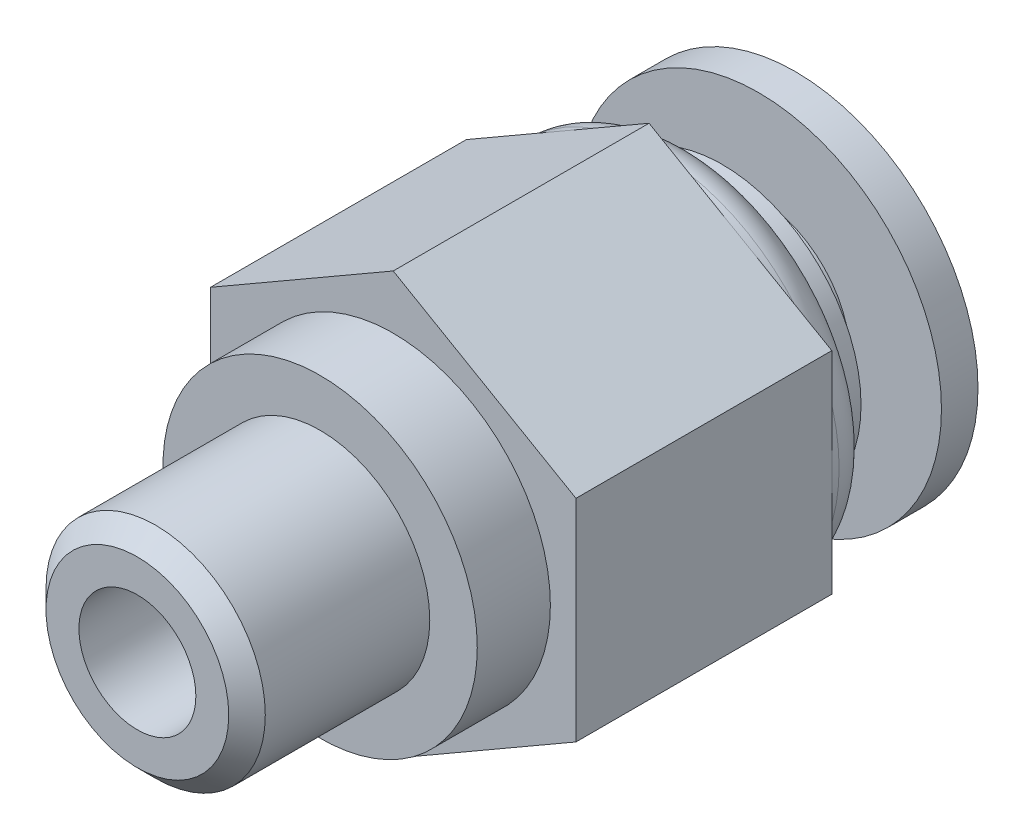
ISO-10303-21;
HEADER;
FILE_DESCRIPTION(('STEP AP214'),'2;1');
FILE_NAME('part.step','',(''),(''),'','','');
FILE_SCHEMA(('AUTOMOTIVE_DESIGN { 1 0 10303 214 1 1 1 1 }'));
ENDSEC;
DATA;
#1=APPLICATION_CONTEXT('core data for automotive mechanical design processes');
#2=APPLICATION_PROTOCOL_DEFINITION('international standard','automotive_design',2000,#1);
#3=PRODUCT_CONTEXT('',#1,'mechanical');
#4=PRODUCT('Part','Part','',(#3));
#5=PRODUCT_RELATED_PRODUCT_CATEGORY('part','',(#4));
#6=PRODUCT_DEFINITION_FORMATION('','',#4);
#7=PRODUCT_DEFINITION_CONTEXT('part definition',#1,'design');
#8=PRODUCT_DEFINITION('design','',#6,#7);
#9=PRODUCT_DEFINITION_SHAPE('','',#8);
#10=(LENGTH_UNIT() NAMED_UNIT(*) SI_UNIT(.MILLI.,.METRE.));
#11=(NAMED_UNIT(*) PLANE_ANGLE_UNIT() SI_UNIT($,.RADIAN.));
#12=(NAMED_UNIT(*) SI_UNIT($,.STERADIAN.) SOLID_ANGLE_UNIT());
#13=UNCERTAINTY_MEASURE_WITH_UNIT(LENGTH_MEASURE(1.E-05),#10,'distance_accuracy_value','');
#14=(GEOMETRIC_REPRESENTATION_CONTEXT(3) GLOBAL_UNCERTAINTY_ASSIGNED_CONTEXT((#13)) GLOBAL_UNIT_ASSIGNED_CONTEXT((#10,
#11,#12)) REPRESENTATION_CONTEXT('',''));
#15=CARTESIAN_POINT('',(0.,0.,0.));
#16=DIRECTION('',(0.,0.,1.));
#17=DIRECTION('',(1.,0.,0.));
#18=AXIS2_PLACEMENT_3D('',#15,#16,#17);
#19=CARTESIAN_POINT('',(0.,2.,-4.));
#20=DIRECTION('',(0.,0.,1.));
#21=DIRECTION('',(0.,-1.,0.));
#22=AXIS2_PLACEMENT_3D('',#19,#20,#21);
#23=PLANE('',#22);
#24=CARTESIAN_POINT('',(0.,0.,-4.));
#25=DIRECTION('',(0.,0.,1.));
#26=DIRECTION('',(0.,-1.,0.));
#27=AXIS2_PLACEMENT_3D('',#24,#25,#26);
#28=CIRCLE('',#27,5.);
#29=CARTESIAN_POINT('',(0.,-5.,-4.));
#30=VERTEX_POINT('',#29);
#31=EDGE_CURVE('E63',#30,#30,#28,.T.);
#32=ORIENTED_EDGE('',*,*,#31,.T.);
#33=EDGE_LOOP('',(#32));
#34=FACE_BOUND('',#33,.T.);
#35=CARTESIAN_POINT('',(0.,0.,-4.));
#36=DIRECTION('',(0.,0.,1.));
#37=DIRECTION('',(0.,-1.,0.));
#38=AXIS2_PLACEMENT_3D('',#35,#36,#37);
#39=CIRCLE('',#38,2.);
#40=CARTESIAN_POINT('',(0.,-2.,-4.));
#41=VERTEX_POINT('',#40);
#42=EDGE_CURVE('E47',#41,#41,#39,.T.);
#43=ORIENTED_EDGE('',*,*,#42,.F.);
#44=EDGE_LOOP('',(#43));
#45=FACE_BOUND('',#44,.T.);
#46=ADVANCED_FACE('F44',(#34,#45),#23,.T.);
#47=CARTESIAN_POINT('',(0.,0.,1.31728685876942));
#48=DIRECTION('',(0.,0.,1.));
#49=DIRECTION('',(0.,-1.,0.));
#50=AXIS2_PLACEMENT_3D('',#47,#48,#49);
#51=CYLINDRICAL_SURFACE('',#50,2.);
#52=ORIENTED_EDGE('',*,*,#42,.T.);
#53=EDGE_LOOP('',(#52));
#54=FACE_BOUND('',#53,.T.);
#55=CARTESIAN_POINT('',(0.,0.,5.));
#56=DIRECTION('',(0.,0.,1.));
#57=DIRECTION('',(0.,-1.,0.));
#58=AXIS2_PLACEMENT_3D('',#55,#56,#57);
#59=CIRCLE('',#58,2.);
#60=CARTESIAN_POINT('',(0.,-2.,5.));
#61=VERTEX_POINT('',#60);
#62=EDGE_CURVE('E61',#61,#61,#59,.T.);
#63=ORIENTED_EDGE('',*,*,#62,.F.);
#64=EDGE_LOOP('',(#63));
#65=FACE_BOUND('',#64,.T.);
#66=ADVANCED_FACE('F70',(#54,#65),#51,.T.);
#67=CARTESIAN_POINT('',(0.,2.5,5.));
#68=DIRECTION('',(0.,0.,-1.));
#69=DIRECTION('',(0.,1.,0.));
#70=AXIS2_PLACEMENT_3D('',#67,#68,#69);
#71=PLANE('',#70);
#72=ORIENTED_EDGE('',*,*,#62,.T.);
#73=EDGE_LOOP('',(#72));
#74=FACE_BOUND('',#73,.T.);
#75=CARTESIAN_POINT('',(0.,0.,5.));
#76=DIRECTION('',(0.,0.,1.));
#77=DIRECTION('',(0.,-1.,0.));
#78=AXIS2_PLACEMENT_3D('',#75,#76,#77);
#79=CIRCLE('',#78,2.5);
#80=CARTESIAN_POINT('',(0.,-2.5,5.));
#81=VERTEX_POINT('',#80);
#82=EDGE_CURVE('E56',#81,#81,#79,.T.);
#83=ORIENTED_EDGE('',*,*,#82,.F.);
#84=EDGE_LOOP('',(#83));
#85=FACE_BOUND('',#84,.T.);
#86=ADVANCED_FACE('F79',(#74,#85),#71,.T.);
#87=CARTESIAN_POINT('',(0.,0.,1.31728685876942));
#88=DIRECTION('',(0.,0.,1.));
#89=DIRECTION('',(0.,-1.,0.));
#90=AXIS2_PLACEMENT_3D('',#87,#88,#89);
#91=CYLINDRICAL_SURFACE('',#90,2.5);
#92=ORIENTED_EDGE('',*,*,#82,.T.);
#93=EDGE_LOOP('',(#92));
#94=FACE_BOUND('',#93,.T.);
#95=CARTESIAN_POINT('',(0.,0.,-3.));
#96=DIRECTION('',(0.,0.,1.));
#97=DIRECTION('',(0.,-1.,0.));
#98=AXIS2_PLACEMENT_3D('',#95,#96,#97);
#99=CIRCLE('',#98,2.5);
#100=CARTESIAN_POINT('',(0.,-2.5,-3.));
#101=VERTEX_POINT('',#100);
#102=EDGE_CURVE('E51',#101,#101,#99,.T.);
#103=ORIENTED_EDGE('',*,*,#102,.F.);
#104=EDGE_LOOP('',(#103));
#105=FACE_BOUND('',#104,.T.);
#106=ADVANCED_FACE('F86',(#94,#105),#91,.F.);
#107=CARTESIAN_POINT('',(0.,5.,-3.));
#108=DIRECTION('',(0.,0.,-1.));
#109=DIRECTION('',(0.,1.,0.));
#110=AXIS2_PLACEMENT_3D('',#107,#108,#109);
#111=PLANE('',#110);
#112=ORIENTED_EDGE('',*,*,#102,.T.);
#113=EDGE_LOOP('',(#112));
#114=FACE_BOUND('',#113,.T.);
#115=CARTESIAN_POINT('',(0.,0.,-3.));
#116=DIRECTION('',(0.,0.,1.));
#117=DIRECTION('',(0.,-1.,0.));
#118=AXIS2_PLACEMENT_3D('',#115,#116,#117);
#119=CIRCLE('',#118,5.);
#120=CARTESIAN_POINT('',(0.,-5.,-3.));
#121=VERTEX_POINT('',#120);
#122=EDGE_CURVE('E11',#121,#121,#119,.T.);
#123=ORIENTED_EDGE('',*,*,#122,.F.);
#124=EDGE_LOOP('',(#123));
#125=FACE_BOUND('',#124,.T.);
#126=ADVANCED_FACE('F82',(#114,#125),#111,.T.);
#127=CARTESIAN_POINT('',(0.,0.,1.31728685876942));
#128=DIRECTION('',(0.,0.,1.));
#129=DIRECTION('',(0.,-1.,0.));
#130=AXIS2_PLACEMENT_3D('',#127,#128,#129);
#131=CYLINDRICAL_SURFACE('',#130,5.);
#132=ORIENTED_EDGE('',*,*,#122,.T.);
#133=EDGE_LOOP('',(#132));
#134=FACE_BOUND('',#133,.T.);
#135=ORIENTED_EDGE('',*,*,#31,.F.);
#136=EDGE_LOOP('',(#135));
#137=FACE_BOUND('',#136,.T.);
#138=ADVANCED_FACE('F45',(#134,#137),#131,.F.);
#139=OPEN_SHELL('',(#46,#66,#86,#106,#126,#138));
#140=SHELL_BASED_SURFACE_MODEL('B2',(#139));
#141=CARTESIAN_POINT('',(0.,0.,-2.));
#142=DIRECTION('',(0.,0.,1.));
#143=DIRECTION('',(1.,0.,0.));
#144=AXIS2_PLACEMENT_3D('',#141,#142,#143);
#145=PLANE('',#144);
#146=CARTESIAN_POINT('',(0.,0.,-2.));
#147=DIRECTION('',(0.,0.,1.));
#148=DIRECTION('',(1.,0.,0.));
#149=AXIS2_PLACEMENT_3D('',#146,#147,#148);
#150=CIRCLE('',#149,3.8);
#151=CARTESIAN_POINT('',(3.8,0.,-2.));
#152=VERTEX_POINT('',#151);
#153=EDGE_CURVE('E276',#152,#152,#150,.T.);
#154=ORIENTED_EDGE('',*,*,#153,.F.);
#155=EDGE_LOOP('',(#154));
#156=FACE_BOUND('',#155,.T.);
#157=CARTESIAN_POINT('',(0.,0.,-2.));
#158=DIRECTION('',(0.,0.,1.));
#159=DIRECTION('',(1.,0.,0.));
#160=AXIS2_PLACEMENT_3D('',#157,#158,#159);
#161=CIRCLE('',#160,3.);
#162=CARTESIAN_POINT('',(3.,0.,-2.));
#163=VERTEX_POINT('',#162);
#164=EDGE_CURVE('E391',#163,#163,#161,.T.);
#165=ORIENTED_EDGE('',*,*,#164,.T.);
#166=EDGE_LOOP('',(#165));
#167=FACE_BOUND('',#166,.T.);
#168=ADVANCED_FACE('F136',(#156,#167),#145,.F.);
#169=CARTESIAN_POINT('',(0.,0.,14.));
#170=DIRECTION('',(0.,0.,1.));
#171=DIRECTION('',(1.,0.,0.));
#172=AXIS2_PLACEMENT_3D('',#169,#170,#171);
#173=PLANE('',#172);
#174=CARTESIAN_POINT('',(0.,0.,14.));
#175=DIRECTION('',(0.,0.,1.));
#176=DIRECTION('',(1.,0.,0.));
#177=AXIS2_PLACEMENT_3D('',#174,#175,#176);
#178=CIRCLE('',#177,2.5);
#179=CARTESIAN_POINT('',(2.5,0.,14.));
#180=VERTEX_POINT('',#179);
#181=EDGE_CURVE('E144',#180,#180,#178,.T.);
#182=ORIENTED_EDGE('',*,*,#181,.T.);
#183=EDGE_LOOP('',(#182));
#184=FACE_BOUND('',#183,.T.);
#185=CARTESIAN_POINT('',(0.,0.,14.));
#186=DIRECTION('',(0.,0.,1.));
#187=DIRECTION('',(1.,0.,0.));
#188=AXIS2_PLACEMENT_3D('',#185,#186,#187);
#189=CIRCLE('',#188,1.6);
#190=CARTESIAN_POINT('',(1.6,0.,14.));
#191=VERTEX_POINT('',#190);
#192=EDGE_CURVE('E286',#191,#191,#189,.T.);
#193=ORIENTED_EDGE('',*,*,#192,.F.);
#194=EDGE_LOOP('',(#193));
#195=FACE_BOUND('',#194,.T.);
#196=ADVANCED_FACE('F291',(#184,#195),#173,.T.);
#197=CARTESIAN_POINT('',(0.,0.,7.));
#198=DIRECTION('',(0.,0.,1.));
#199=DIRECTION('',(1.,0.,0.));
#200=AXIS2_PLACEMENT_3D('',#197,#198,#199);
#201=PLANE('',#200);
#202=DIRECTION('',(-0.866025403784439,0.5,0.));
#203=VECTOR('',#202,1.);
#204=CARTESIAN_POINT('',(5.,2.88675134594813,7.));
#205=LINE('',#204,#203);
#206=CARTESIAN_POINT('',(5.,2.88675134594813,7.));
#207=VERTEX_POINT('',#206);
#208=CARTESIAN_POINT('',(0.,5.77350269189626,7.));
#209=VERTEX_POINT('',#208);
#210=EDGE_CURVE('E256',#207,#209,#205,.T.);
#211=ORIENTED_EDGE('',*,*,#210,.T.);
#212=DIRECTION('',(-0.866025403784438,-0.5,0.));
#213=VECTOR('',#212,1.);
#214=CARTESIAN_POINT('',(0.,5.77350269189626,7.));
#215=LINE('',#214,#213);
#216=CARTESIAN_POINT('',(-5.,2.88675134594813,7.));
#217=VERTEX_POINT('',#216);
#218=EDGE_CURVE('E196',#209,#217,#215,.T.);
#219=ORIENTED_EDGE('',*,*,#218,.T.);
#220=DIRECTION('',(0.,-1.,0.));
#221=VECTOR('',#220,1.);
#222=CARTESIAN_POINT('',(-5.,2.88675134594813,7.));
#223=LINE('',#222,#221);
#224=CARTESIAN_POINT('',(-5.,-2.88675134594813,7.));
#225=VERTEX_POINT('',#224);
#226=EDGE_CURVE('E213',#217,#225,#223,.T.);
#227=ORIENTED_EDGE('',*,*,#226,.T.);
#228=DIRECTION('',(0.866025403784438,-0.5,0.));
#229=VECTOR('',#228,1.);
#230=CARTESIAN_POINT('',(-5.,-2.88675134594813,7.));
#231=LINE('',#230,#229);
#232=CARTESIAN_POINT('',(0.,-5.77350269189626,7.));
#233=VERTEX_POINT('',#232);
#234=EDGE_CURVE('E205',#225,#233,#231,.T.);
#235=ORIENTED_EDGE('',*,*,#234,.T.);
#236=DIRECTION('',(0.866025403784438,0.5,0.));
#237=VECTOR('',#236,1.);
#238=CARTESIAN_POINT('',(0.,-5.77350269189626,7.));
#239=LINE('',#238,#237);
#240=CARTESIAN_POINT('',(5.,-2.88675134594813,7.));
#241=VERTEX_POINT('',#240);
#242=EDGE_CURVE('E210',#233,#241,#239,.T.);
#243=ORIENTED_EDGE('',*,*,#242,.T.);
#244=DIRECTION('',(0.,1.,0.));
#245=VECTOR('',#244,1.);
#246=CARTESIAN_POINT('',(5.,-2.88675134594813,7.));
#247=LINE('',#246,#245);
#248=EDGE_CURVE('E160',#241,#207,#247,.T.);
#249=ORIENTED_EDGE('',*,*,#248,.T.);
#250=EDGE_LOOP('',(#211,#219,#227,#235,#243,#249));
#251=FACE_BOUND('',#250,.T.);
#252=CARTESIAN_POINT('',(0.,0.,7.));
#253=DIRECTION('',(0.,0.,1.));
#254=DIRECTION('',(1.,0.,0.));
#255=AXIS2_PLACEMENT_3D('',#252,#253,#254);
#256=CIRCLE('',#255,4.3);
#257=CARTESIAN_POINT('',(4.3,0.,7.));
#258=VERTEX_POINT('',#257);
#259=EDGE_CURVE('E269',#258,#258,#256,.F.);
#260=ORIENTED_EDGE('',*,*,#259,.T.);
#261=EDGE_LOOP('',(#260));
#262=FACE_BOUND('',#261,.T.);
#263=ADVANCED_FACE('F207',(#251,#262),#201,.T.);
#264=CARTESIAN_POINT('',(0.,0.,0.));
#265=DIRECTION('',(0.,0.,1.));
#266=DIRECTION('',(1.,0.,0.));
#267=AXIS2_PLACEMENT_3D('',#264,#265,#266);
#268=PLANE('',#267);
#269=DIRECTION('',(0.,1.,0.));
#270=VECTOR('',#269,1.);
#271=CARTESIAN_POINT('',(5.,-2.88675134594813,0.));
#272=LINE('',#271,#270);
#273=CARTESIAN_POINT('',(5.,0.,0.));
#274=VERTEX_POINT('',#273);
#275=CARTESIAN_POINT('',(5.,2.88675134594813,0.));
#276=VERTEX_POINT('',#275);
#277=EDGE_CURVE('E187',#274,#276,#272,.T.);
#278=ORIENTED_EDGE('',*,*,#277,.F.);
#279=CARTESIAN_POINT('',(0.,0.,0.));
#280=DIRECTION('',(0.,0.,1.));
#281=DIRECTION('',(1.,0.,0.));
#282=AXIS2_PLACEMENT_3D('',#279,#280,#281);
#283=CIRCLE('',#282,5.);
#284=CARTESIAN_POINT('',(2.5,4.33012701892219,0.));
#285=VERTEX_POINT('',#284);
#286=EDGE_CURVE('E151',#274,#285,#283,.T.);
#287=ORIENTED_EDGE('',*,*,#286,.T.);
#288=DIRECTION('',(-0.866025403784439,0.5,0.));
#289=VECTOR('',#288,1.);
#290=CARTESIAN_POINT('',(5.,2.88675134594813,0.));
#291=LINE('',#290,#289);
#292=EDGE_CURVE('E237',#276,#285,#291,.T.);
#293=ORIENTED_EDGE('',*,*,#292,.F.);
#294=EDGE_LOOP('',(#278,#287,#293));
#295=FACE_BOUND('',#294,.T.);
#296=ADVANCED_FACE('F345',(#295),#268,.F.);
#297=CARTESIAN_POINT('',(0.,5.77350269189626,0.));
#298=VERTEX_POINT('',#297);
#299=EDGE_CURVE('E241',#285,#298,#291,.T.);
#300=ORIENTED_EDGE('',*,*,#299,.F.);
#301=CARTESIAN_POINT('',(-2.5,4.33012701892219,0.));
#302=VERTEX_POINT('',#301);
#303=EDGE_CURVE('E281',#285,#302,#283,.T.);
#304=ORIENTED_EDGE('',*,*,#303,.T.);
#305=DIRECTION('',(-0.866025403784438,-0.5,0.));
#306=VECTOR('',#305,1.);
#307=CARTESIAN_POINT('',(0.,5.77350269189626,0.));
#308=LINE('',#307,#306);
#309=EDGE_CURVE('E242',#298,#302,#308,.T.);
#310=ORIENTED_EDGE('',*,*,#309,.F.);
#311=EDGE_LOOP('',(#300,#304,#310));
#312=FACE_BOUND('',#311,.T.);
#313=ADVANCED_FACE('F429',(#312),#268,.F.);
#314=CARTESIAN_POINT('',(-5.,2.88675134594813,0.));
#315=VERTEX_POINT('',#314);
#316=EDGE_CURVE('E240',#302,#315,#308,.T.);
#317=ORIENTED_EDGE('',*,*,#316,.F.);
#318=CARTESIAN_POINT('',(-5.,0.,0.));
#319=VERTEX_POINT('',#318);
#320=EDGE_CURVE('E414',#302,#319,#283,.T.);
#321=ORIENTED_EDGE('',*,*,#320,.T.);
#322=DIRECTION('',(0.,-1.,0.));
#323=VECTOR('',#322,1.);
#324=CARTESIAN_POINT('',(-5.,2.88675134594813,0.));
#325=LINE('',#324,#323);
#326=EDGE_CURVE('E246',#315,#319,#325,.T.);
#327=ORIENTED_EDGE('',*,*,#326,.F.);
#328=EDGE_LOOP('',(#317,#321,#327));
#329=FACE_BOUND('',#328,.T.);
#330=ADVANCED_FACE('F431',(#329),#268,.F.);
#331=CARTESIAN_POINT('',(-5.,-2.88675134594813,0.));
#332=VERTEX_POINT('',#331);
#333=EDGE_CURVE('E245',#319,#332,#325,.T.);
#334=ORIENTED_EDGE('',*,*,#333,.F.);
#335=CARTESIAN_POINT('',(-2.5,-4.33012701892219,0.));
#336=VERTEX_POINT('',#335);
#337=EDGE_CURVE('E410',#319,#336,#283,.T.);
#338=ORIENTED_EDGE('',*,*,#337,.T.);
#339=DIRECTION('',(0.866025403784438,-0.5,0.));
#340=VECTOR('',#339,1.);
#341=CARTESIAN_POINT('',(-5.,-2.88675134594813,0.));
#342=LINE('',#341,#340);
#343=EDGE_CURVE('E249',#332,#336,#342,.T.);
#344=ORIENTED_EDGE('',*,*,#343,.F.);
#345=EDGE_LOOP('',(#334,#338,#344));
#346=FACE_BOUND('',#345,.T.);
#347=ADVANCED_FACE('F407',(#346),#268,.F.);
#348=CARTESIAN_POINT('',(0.,-5.77350269189626,0.));
#349=VERTEX_POINT('',#348);
#350=EDGE_CURVE('E223',#336,#349,#342,.T.);
#351=ORIENTED_EDGE('',*,*,#350,.F.);
#352=CARTESIAN_POINT('',(2.5,-4.33012701892219,0.));
#353=VERTEX_POINT('',#352);
#354=EDGE_CURVE('E415',#336,#353,#283,.T.);
#355=ORIENTED_EDGE('',*,*,#354,.T.);
#356=DIRECTION('',(0.866025403784438,0.5,0.));
#357=VECTOR('',#356,1.);
#358=CARTESIAN_POINT('',(0.,-5.77350269189626,0.));
#359=LINE('',#358,#357);
#360=EDGE_CURVE('E252',#349,#353,#359,.T.);
#361=ORIENTED_EDGE('',*,*,#360,.F.);
#362=EDGE_LOOP('',(#351,#355,#361));
#363=FACE_BOUND('',#362,.T.);
#364=ADVANCED_FACE('F350',(#363),#268,.F.);
#365=CARTESIAN_POINT('',(5.,2.88675134594813,7.));
#366=DIRECTION('',(-0.5,-0.866025403784439,0.));
#367=DIRECTION('',(0.866025403784439,-0.5,0.));
#368=AXIS2_PLACEMENT_3D('',#365,#366,#367);
#369=PLANE('',#368);
#370=ORIENTED_EDGE('',*,*,#292,.T.);
#371=ORIENTED_EDGE('',*,*,#299,.T.);
#372=DIRECTION('',(0.,0.,-1.));
#373=VECTOR('',#372,1.);
#374=CARTESIAN_POINT('',(0.,5.77350269189626,7.));
#375=LINE('',#374,#373);
#376=EDGE_CURVE('E263',#209,#298,#375,.T.);
#377=ORIENTED_EDGE('',*,*,#376,.F.);
#378=ORIENTED_EDGE('',*,*,#210,.F.);
#379=DIRECTION('',(0.,0.,-1.));
#380=VECTOR('',#379,1.);
#381=CARTESIAN_POINT('',(5.,2.88675134594813,7.));
#382=LINE('',#381,#380);
#383=EDGE_CURVE('E233',#207,#276,#382,.T.);
#384=ORIENTED_EDGE('',*,*,#383,.T.);
#385=EDGE_LOOP('',(#370,#371,#377,#378,#384));
#386=FACE_BOUND('',#385,.T.);
#387=ADVANCED_FACE('F364',(#386),#369,.F.);
#388=CARTESIAN_POINT('',(0.,5.77350269189626,7.));
#389=DIRECTION('',(0.5,-0.866025403784438,0.));
#390=DIRECTION('',(0.866025403784439,0.5,0.));
#391=AXIS2_PLACEMENT_3D('',#388,#389,#390);
#392=PLANE('',#391);
#393=ORIENTED_EDGE('',*,*,#309,.T.);
#394=ORIENTED_EDGE('',*,*,#316,.T.);
#395=DIRECTION('',(0.,0.,-1.));
#396=VECTOR('',#395,1.);
#397=CARTESIAN_POINT('',(-5.,2.88675134594813,7.));
#398=LINE('',#397,#396);
#399=EDGE_CURVE('E260',#217,#315,#398,.T.);
#400=ORIENTED_EDGE('',*,*,#399,.F.);
#401=ORIENTED_EDGE('',*,*,#218,.F.);
#402=ORIENTED_EDGE('',*,*,#376,.T.);
#403=EDGE_LOOP('',(#393,#394,#400,#401,#402));
#404=FACE_BOUND('',#403,.T.);
#405=ADVANCED_FACE('F360',(#404),#392,.F.);
#406=CARTESIAN_POINT('',(-5.,2.88675134594813,7.));
#407=DIRECTION('',(1.,0.,0.));
#408=DIRECTION('',(0.,1.,0.));
#409=AXIS2_PLACEMENT_3D('',#406,#407,#408);
#410=PLANE('',#409);
#411=ORIENTED_EDGE('',*,*,#326,.T.);
#412=ORIENTED_EDGE('',*,*,#333,.T.);
#413=DIRECTION('',(0.,0.,-1.));
#414=VECTOR('',#413,1.);
#415=CARTESIAN_POINT('',(-5.,-2.88675134594813,7.));
#416=LINE('',#415,#414);
#417=EDGE_CURVE('E227',#225,#332,#416,.T.);
#418=ORIENTED_EDGE('',*,*,#417,.F.);
#419=ORIENTED_EDGE('',*,*,#226,.F.);
#420=ORIENTED_EDGE('',*,*,#399,.T.);
#421=EDGE_LOOP('',(#411,#412,#418,#419,#420));
#422=FACE_BOUND('',#421,.T.);
#423=ADVANCED_FACE('F357',(#422),#410,.F.);
#424=CARTESIAN_POINT('',(-5.,-2.88675134594813,7.));
#425=DIRECTION('',(0.5,0.866025403784438,0.));
#426=DIRECTION('',(-0.866025403784438,0.5,0.));
#427=AXIS2_PLACEMENT_3D('',#424,#425,#426);
#428=PLANE('',#427);
#429=ORIENTED_EDGE('',*,*,#343,.T.);
#430=ORIENTED_EDGE('',*,*,#350,.T.);
#431=DIRECTION('',(0.,0.,-1.));
#432=VECTOR('',#431,1.);
#433=CARTESIAN_POINT('',(0.,-5.77350269189626,7.));
#434=LINE('',#433,#432);
#435=EDGE_CURVE('E219',#233,#349,#434,.T.);
#436=ORIENTED_EDGE('',*,*,#435,.F.);
#437=ORIENTED_EDGE('',*,*,#234,.F.);
#438=ORIENTED_EDGE('',*,*,#417,.T.);
#439=EDGE_LOOP('',(#429,#430,#436,#437,#438));
#440=FACE_BOUND('',#439,.T.);
#441=ADVANCED_FACE('F221',(#440),#428,.F.);
#442=CARTESIAN_POINT('',(0.,-5.77350269189626,7.));
#443=DIRECTION('',(-0.5,0.866025403784439,0.));
#444=DIRECTION('',(-0.866025403784439,-0.5,0.));
#445=AXIS2_PLACEMENT_3D('',#442,#443,#444);
#446=PLANE('',#445);
#447=ORIENTED_EDGE('',*,*,#360,.T.);
#448=CARTESIAN_POINT('',(5.,-2.88675134594813,0.));
#449=VERTEX_POINT('',#448);
#450=EDGE_CURVE('E251',#353,#449,#359,.T.);
#451=ORIENTED_EDGE('',*,*,#450,.T.);
#452=DIRECTION('',(0.,0.,-1.));
#453=VECTOR('',#452,1.);
#454=CARTESIAN_POINT('',(5.,-2.88675134594813,7.));
#455=LINE('',#454,#453);
#456=EDGE_CURVE('E228',#241,#449,#455,.T.);
#457=ORIENTED_EDGE('',*,*,#456,.F.);
#458=ORIENTED_EDGE('',*,*,#242,.F.);
#459=ORIENTED_EDGE('',*,*,#435,.T.);
#460=EDGE_LOOP('',(#447,#451,#457,#458,#459));
#461=FACE_BOUND('',#460,.T.);
#462=ADVANCED_FACE('F230',(#461),#446,.F.);
#463=CARTESIAN_POINT('',(5.,-2.88675134594813,7.));
#464=DIRECTION('',(-1.,0.,0.));
#465=DIRECTION('',(0.,0.,1.));
#466=AXIS2_PLACEMENT_3D('',#463,#464,#465);
#467=PLANE('',#466);
#468=EDGE_CURVE('E254',#449,#274,#272,.T.);
#469=ORIENTED_EDGE('',*,*,#468,.T.);
#470=ORIENTED_EDGE('',*,*,#277,.T.);
#471=ORIENTED_EDGE('',*,*,#383,.F.);
#472=ORIENTED_EDGE('',*,*,#248,.F.);
#473=ORIENTED_EDGE('',*,*,#456,.T.);
#474=EDGE_LOOP('',(#469,#470,#471,#472,#473));
#475=FACE_BOUND('',#474,.T.);
#476=ADVANCED_FACE('F348',(#475),#467,.F.);
#477=ORIENTED_EDGE('',*,*,#450,.F.);
#478=EDGE_CURVE('E265',#353,#274,#283,.T.);
#479=ORIENTED_EDGE('',*,*,#478,.T.);
#480=ORIENTED_EDGE('',*,*,#468,.F.);
#481=EDGE_LOOP('',(#477,#479,#480));
#482=FACE_BOUND('',#481,.T.);
#483=ADVANCED_FACE('F341',(#482),#268,.F.);
#484=CARTESIAN_POINT('',(0.,0.,-1.2));
#485=DIRECTION('',(0.,0.,1.));
#486=DIRECTION('',(1.,0.,0.));
#487=AXIS2_PLACEMENT_3D('',#484,#485,#486);
#488=CYLINDRICAL_SURFACE('',#487,5.);
#489=CARTESIAN_POINT('',(0.,0.,-0.2));
#490=DIRECTION('',(0.,0.,1.));
#491=DIRECTION('',(1.,0.,0.));
#492=AXIS2_PLACEMENT_3D('',#489,#490,#491);
#493=CIRCLE('',#492,5.);
#494=CARTESIAN_POINT('',(5.,0.,-0.2));
#495=VERTEX_POINT('',#494);
#496=EDGE_CURVE('E277',#495,#495,#493,.T.);
#497=ORIENTED_EDGE('',*,*,#496,.T.);
#498=EDGE_LOOP('',(#497));
#499=FACE_BOUND('',#498,.T.);
#500=ORIENTED_EDGE('',*,*,#286,.F.);
#501=ORIENTED_EDGE('',*,*,#478,.F.);
#502=ORIENTED_EDGE('',*,*,#354,.F.);
#503=ORIENTED_EDGE('',*,*,#337,.F.);
#504=ORIENTED_EDGE('',*,*,#320,.F.);
#505=ORIENTED_EDGE('',*,*,#303,.F.);
#506=EDGE_LOOP('',(#500,#501,#502,#503,#504,#505));
#507=FACE_BOUND('',#506,.T.);
#508=ADVANCED_FACE('F337',(#499,#507),#488,.T.);
#509=CARTESIAN_POINT('',(0.,0.,-1.2));
#510=DIRECTION('',(0.,0.,1.));
#511=DIRECTION('',(1.,0.,0.));
#512=AXIS2_PLACEMENT_3D('',#509,#510,#511);
#513=PLANE('',#512);
#514=CARTESIAN_POINT('',(0.,0.,-1.2));
#515=DIRECTION('',(0.,0.,1.));
#516=DIRECTION('',(1.,0.,0.));
#517=AXIS2_PLACEMENT_3D('',#514,#515,#516);
#518=CIRCLE('',#517,4.);
#519=CARTESIAN_POINT('',(4.,0.,-1.2));
#520=VERTEX_POINT('',#519);
#521=EDGE_CURVE('E280',#520,#520,#518,.F.);
#522=ORIENTED_EDGE('',*,*,#521,.T.);
#523=EDGE_LOOP('',(#522));
#524=FACE_BOUND('',#523,.T.);
#525=CARTESIAN_POINT('',(0.,0.,-1.2));
#526=DIRECTION('',(0.,0.,1.));
#527=DIRECTION('',(1.,0.,0.));
#528=AXIS2_PLACEMENT_3D('',#525,#526,#527);
#529=CIRCLE('',#528,3.8);
#530=CARTESIAN_POINT('',(3.8,0.,-1.2));
#531=VERTEX_POINT('',#530);
#532=EDGE_CURVE('E273',#531,#531,#529,.T.);
#533=ORIENTED_EDGE('',*,*,#532,.T.);
#534=EDGE_LOOP('',(#533));
#535=FACE_BOUND('',#534,.T.);
#536=ADVANCED_FACE('F327',(#524,#535),#513,.F.);
#537=CARTESIAN_POINT('',(0.,0.,9.));
#538=DIRECTION('',(0.,0.,1.));
#539=DIRECTION('',(1.,0.,0.));
#540=AXIS2_PLACEMENT_3D('',#537,#538,#539);
#541=PLANE('',#540);
#542=CARTESIAN_POINT('',(0.,0.,9.));
#543=DIRECTION('',(0.,0.,1.));
#544=DIRECTION('',(1.,0.,0.));
#545=AXIS2_PLACEMENT_3D('',#542,#543,#544);
#546=CIRCLE('',#545,4.3);
#547=CARTESIAN_POINT('',(4.3,0.,9.));
#548=VERTEX_POINT('',#547);
#549=EDGE_CURVE('E270',#548,#548,#546,.T.);
#550=ORIENTED_EDGE('',*,*,#549,.T.);
#551=EDGE_LOOP('',(#550));
#552=FACE_BOUND('',#551,.T.);
#553=CARTESIAN_POINT('',(0.,0.,9.));
#554=DIRECTION('',(0.,0.,1.));
#555=DIRECTION('',(1.,0.,0.));
#556=AXIS2_PLACEMENT_3D('',#553,#554,#555);
#557=CIRCLE('',#556,3.);
#558=CARTESIAN_POINT('',(3.,0.,9.));
#559=VERTEX_POINT('',#558);
#560=EDGE_CURVE('E266',#559,#559,#557,.T.);
#561=ORIENTED_EDGE('',*,*,#560,.F.);
#562=EDGE_LOOP('',(#561));
#563=FACE_BOUND('',#562,.T.);
#564=ADVANCED_FACE('F323',(#552,#563),#541,.T.);
#565=CARTESIAN_POINT('',(0.,0.,9.));
#566=DIRECTION('',(0.,0.,-1.));
#567=DIRECTION('',(-1.,0.,0.));
#568=AXIS2_PLACEMENT_3D('',#565,#566,#567);
#569=CYLINDRICAL_SURFACE('',#568,4.3);
#570=ORIENTED_EDGE('',*,*,#259,.F.);
#571=EDGE_LOOP('',(#570));
#572=FACE_BOUND('',#571,.T.);
#573=ORIENTED_EDGE('',*,*,#549,.F.);
#574=EDGE_LOOP('',(#573));
#575=FACE_BOUND('',#574,.T.);
#576=ADVANCED_FACE('F326',(#572,#575),#569,.T.);
#577=CARTESIAN_POINT('',(0.,0.,14.));
#578=DIRECTION('',(0.,0.,-1.));
#579=DIRECTION('',(-1.,0.,0.));
#580=AXIS2_PLACEMENT_3D('',#577,#578,#579);
#581=CYLINDRICAL_SURFACE('',#580,3.);
#582=CARTESIAN_POINT('',(0.,0.,13.5));
#583=DIRECTION('',(0.,0.,1.));
#584=DIRECTION('',(1.,0.,0.));
#585=AXIS2_PLACEMENT_3D('',#582,#583,#584);
#586=CIRCLE('',#585,3.);
#587=CARTESIAN_POINT('',(3.,0.,13.5));
#588=VERTEX_POINT('',#587);
#589=EDGE_CURVE('E42',#588,#588,#586,.F.);
#590=ORIENTED_EDGE('',*,*,#589,.T.);
#591=EDGE_LOOP('',(#590));
#592=FACE_BOUND('',#591,.T.);
#593=ORIENTED_EDGE('',*,*,#560,.T.);
#594=EDGE_LOOP('',(#593));
#595=FACE_BOUND('',#594,.T.);
#596=ADVANCED_FACE('F321',(#592,#595),#581,.T.);
#597=CARTESIAN_POINT('',(0.,0.,-2.));
#598=DIRECTION('',(0.,0.,1.));
#599=DIRECTION('',(1.,0.,0.));
#600=AXIS2_PLACEMENT_3D('',#597,#598,#599);
#601=CYLINDRICAL_SURFACE('',#600,3.8);
#602=ORIENTED_EDGE('',*,*,#153,.T.);
#603=EDGE_LOOP('',(#602));
#604=FACE_BOUND('',#603,.T.);
#605=ORIENTED_EDGE('',*,*,#532,.F.);
#606=EDGE_LOOP('',(#605));
#607=FACE_BOUND('',#606,.T.);
#608=ADVANCED_FACE('F317',(#604,#607),#601,.T.);
#609=CARTESIAN_POINT('',(0.,0.,-0.2));
#610=DIRECTION('',(0.,0.,1.));
#611=DIRECTION('',(1.,0.,0.));
#612=AXIS2_PLACEMENT_3D('',#609,#610,#611);
#613=TOROIDAL_SURFACE('',#612,4.,1.);
#614=ORIENTED_EDGE('',*,*,#521,.F.);
#615=EDGE_LOOP('',(#614));
#616=FACE_BOUND('',#615,.T.);
#617=ORIENTED_EDGE('',*,*,#496,.F.);
#618=EDGE_LOOP('',(#617));
#619=FACE_BOUND('',#618,.T.);
#620=ADVANCED_FACE('F320',(#616,#619),#613,.T.);
#621=CARTESIAN_POINT('',(0.,0.,14.));
#622=DIRECTION('',(0.,0.,-1.));
#623=DIRECTION('',(-1.,0.,0.));
#624=AXIS2_PLACEMENT_3D('',#621,#622,#623);
#625=CYLINDRICAL_SURFACE('',#624,1.6);
#626=CARTESIAN_POINT('',(0.,0.,5.));
#627=DIRECTION('',(0.,0.,1.));
#628=DIRECTION('',(1.,0.,0.));
#629=AXIS2_PLACEMENT_3D('',#626,#627,#628);
#630=CIRCLE('',#629,1.6);
#631=CARTESIAN_POINT('',(1.6,0.,5.));
#632=VERTEX_POINT('',#631);
#633=EDGE_CURVE('E284',#632,#632,#630,.T.);
#634=ORIENTED_EDGE('',*,*,#633,.F.);
#635=EDGE_LOOP('',(#634));
#636=FACE_BOUND('',#635,.T.);
#637=ORIENTED_EDGE('',*,*,#192,.T.);
#638=EDGE_LOOP('',(#637));
#639=FACE_BOUND('',#638,.T.);
#640=ADVANCED_FACE('F315',(#636,#639),#625,.F.);
#641=CARTESIAN_POINT('',(0.,0.,5.));
#642=DIRECTION('',(0.,0.,-1.));
#643=DIRECTION('',(-1.,0.,0.));
#644=AXIS2_PLACEMENT_3D('',#641,#642,#643);
#645=CYLINDRICAL_SURFACE('',#644,3.);
#646=CARTESIAN_POINT('',(0.,0.,5.));
#647=DIRECTION('',(0.,0.,1.));
#648=DIRECTION('',(1.,0.,0.));
#649=AXIS2_PLACEMENT_3D('',#646,#647,#648);
#650=CIRCLE('',#649,3.);
#651=CARTESIAN_POINT('',(3.,0.,5.));
#652=VERTEX_POINT('',#651);
#653=EDGE_CURVE('E287',#652,#652,#650,.T.);
#654=ORIENTED_EDGE('',*,*,#653,.T.);
#655=EDGE_LOOP('',(#654));
#656=FACE_BOUND('',#655,.T.);
#657=ORIENTED_EDGE('',*,*,#164,.F.);
#658=EDGE_LOOP('',(#657));
#659=FACE_BOUND('',#658,.T.);
#660=ADVANCED_FACE('F300',(#656,#659),#645,.F.);
#661=CARTESIAN_POINT('',(0.,0.,5.));
#662=DIRECTION('',(0.,0.,1.));
#663=DIRECTION('',(1.,0.,0.));
#664=AXIS2_PLACEMENT_3D('',#661,#662,#663);
#665=PLANE('',#664);
#666=ORIENTED_EDGE('',*,*,#633,.T.);
#667=EDGE_LOOP('',(#666));
#668=FACE_BOUND('',#667,.T.);
#669=ORIENTED_EDGE('',*,*,#653,.F.);
#670=EDGE_LOOP('',(#669));
#671=FACE_BOUND('',#670,.T.);
#672=ADVANCED_FACE('F295',(#668,#671),#665,.F.);
#673=CARTESIAN_POINT('',(0.,0.,14.));
#674=DIRECTION('',(0.,0.,-1.));
#675=DIRECTION('',(-1.,0.,0.));
#676=AXIS2_PLACEMENT_3D('',#673,#674,#675);
#677=CONICAL_SURFACE('',#676,2.5,0.785398163397446);
#678=ORIENTED_EDGE('',*,*,#589,.F.);
#679=EDGE_LOOP('',(#678));
#680=FACE_BOUND('',#679,.T.);
#681=ORIENTED_EDGE('',*,*,#181,.F.);
#682=EDGE_LOOP('',(#681));
#683=FACE_BOUND('',#682,.T.);
#684=ADVANCED_FACE('F138',(#680,#683),#677,.T.);
#685=CLOSED_SHELL('',(#168,#196,#263,#296,#313,#330,#347,#364,#387,#405,#423,#441,#462,#476,
#483,#508,#536,#564,#576,#596,#608,#620,#640,#660,#672,#684));
#686=MANIFOLD_SOLID_BREP('B6',#685);
#687=ADVANCED_BREP_SHAPE_REPRESENTATION('',(#18,#686),#14);
#688=MANIFOLD_SURFACE_SHAPE_REPRESENTATION('',(#18,#140),#14);
#689=SHAPE_REPRESENTATION('',(#18),#14);
#690=SHAPE_DEFINITION_REPRESENTATION(#9,#689);
#691=SHAPE_REPRESENTATION_RELATIONSHIP('','',#689,#687);
#692=SHAPE_REPRESENTATION_RELATIONSHIP('','',#689,#688);
ENDSEC;
END-ISO-10303-21;
